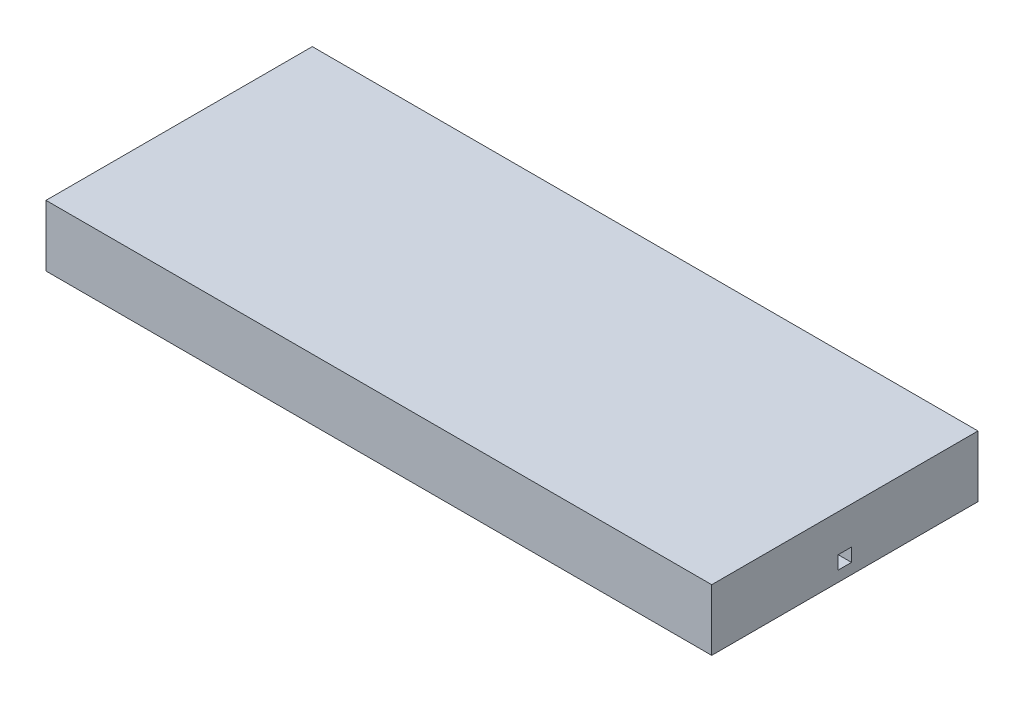
ISO-10303-21;
HEADER;
FILE_DESCRIPTION(('STEP AP214'),'2;1');
FILE_NAME('part.step','',(''),(''),'','','');
FILE_SCHEMA(('AUTOMOTIVE_DESIGN { 1 0 10303 214 1 1 1 1 }'));
ENDSEC;
DATA;
#1=APPLICATION_CONTEXT('core data for automotive mechanical design processes');
#2=APPLICATION_PROTOCOL_DEFINITION('international standard','automotive_design',2000,#1);
#3=PRODUCT_CONTEXT('',#1,'mechanical');
#4=PRODUCT('Part','Part','',(#3));
#5=PRODUCT_RELATED_PRODUCT_CATEGORY('part','',(#4));
#6=PRODUCT_DEFINITION_FORMATION('','',#4);
#7=PRODUCT_DEFINITION_CONTEXT('part definition',#1,'design');
#8=PRODUCT_DEFINITION('design','',#6,#7);
#9=PRODUCT_DEFINITION_SHAPE('','',#8);
#10=(LENGTH_UNIT() NAMED_UNIT(*) SI_UNIT(.MILLI.,.METRE.));
#11=(NAMED_UNIT(*) PLANE_ANGLE_UNIT() SI_UNIT($,.RADIAN.));
#12=(NAMED_UNIT(*) SI_UNIT($,.STERADIAN.) SOLID_ANGLE_UNIT());
#13=UNCERTAINTY_MEASURE_WITH_UNIT(LENGTH_MEASURE(1.E-05),#10,'distance_accuracy_value','');
#14=(GEOMETRIC_REPRESENTATION_CONTEXT(3) GLOBAL_UNCERTAINTY_ASSIGNED_CONTEXT((#13)) GLOBAL_UNIT_ASSIGNED_CONTEXT((#10,
#11,#12)) REPRESENTATION_CONTEXT('',''));
#15=CARTESIAN_POINT('',(0.,0.,0.));
#16=DIRECTION('',(0.,0.,1.));
#17=DIRECTION('',(1.,0.,0.));
#18=AXIS2_PLACEMENT_3D('',#15,#16,#17);
#19=CARTESIAN_POINT('',(25.001,0.400000000000001,-4.75));
#20=DIRECTION('',(0.,-1.,0.));
#21=DIRECTION('',(0.,0.,-1.));
#22=AXIS2_PLACEMENT_3D('',#19,#20,#21);
#23=PLANE('',#22);
#24=DIRECTION('',(-1.,0.,0.));
#25=VECTOR('',#24,1.);
#26=CARTESIAN_POINT('',(25.001,0.400000000000001,-5.25));
#27=LINE('',#26,#25);
#28=CARTESIAN_POINT('',(7.77500000000001,0.4,-5.25));
#29=VERTEX_POINT('',#28);
#30=CARTESIAN_POINT('',(5.625,0.4,-5.25));
#31=VERTEX_POINT('',#30);
#32=EDGE_CURVE('E418',#29,#31,#27,.T.);
#33=ORIENTED_EDGE('',*,*,#32,.T.);
#34=DIRECTION('',(0.,0.,1.));
#35=VECTOR('',#34,1.);
#36=CARTESIAN_POINT('',(5.625,0.4,-6.));
#37=LINE('',#36,#35);
#38=CARTESIAN_POINT('',(5.625,0.4,-4.75));
#39=VERTEX_POINT('',#38);
#40=EDGE_CURVE('E221',#31,#39,#37,.T.);
#41=ORIENTED_EDGE('',*,*,#40,.T.);
#42=DIRECTION('',(-1.,0.,0.));
#43=VECTOR('',#42,1.);
#44=CARTESIAN_POINT('',(25.001,0.400000000000001,-4.75));
#45=LINE('',#44,#43);
#46=CARTESIAN_POINT('',(7.775,0.400000000000001,-4.75));
#47=VERTEX_POINT('',#46);
#48=EDGE_CURVE('E448',#47,#39,#45,.T.);
#49=ORIENTED_EDGE('',*,*,#48,.F.);
#50=DIRECTION('',(0.,0.,-1.));
#51=VECTOR('',#50,1.);
#52=CARTESIAN_POINT('',(7.775,0.4,-4.225));
#53=LINE('',#52,#51);
#54=EDGE_CURVE('E338',#47,#29,#53,.T.);
#55=ORIENTED_EDGE('',*,*,#54,.T.);
#56=EDGE_LOOP('',(#33,#41,#49,#55));
#57=FACE_BOUND('',#56,.T.);
#58=ADVANCED_FACE('F39',(#57),#23,.F.);
#59=CARTESIAN_POINT('',(25.,0.400000000000001,-5.25));
#60=VERTEX_POINT('',#59);
#61=CARTESIAN_POINT('',(12.025,0.4,-5.25));
#62=VERTEX_POINT('',#61);
#63=EDGE_CURVE('E324',#60,#62,#27,.T.);
#64=ORIENTED_EDGE('',*,*,#63,.T.);
#65=DIRECTION('',(0.,0.,1.));
#66=VECTOR('',#65,1.);
#67=CARTESIAN_POINT('',(12.025,0.400000000000001,-4.75));
#68=LINE('',#67,#66);
#69=CARTESIAN_POINT('',(12.025,0.4,-4.75));
#70=VERTEX_POINT('',#69);
#71=EDGE_CURVE('E11',#62,#70,#68,.T.);
#72=ORIENTED_EDGE('',*,*,#71,.T.);
#73=CARTESIAN_POINT('',(25.,0.400000000000001,-4.75));
#74=VERTEX_POINT('',#73);
#75=EDGE_CURVE('E318',#74,#70,#45,.T.);
#76=ORIENTED_EDGE('',*,*,#75,.F.);
#77=DIRECTION('',(0.,0.,-1.));
#78=VECTOR('',#77,1.);
#79=CARTESIAN_POINT('',(25.,0.400000000000001,-4.75));
#80=LINE('',#79,#78);
#81=EDGE_CURVE('E315',#74,#60,#80,.T.);
#82=ORIENTED_EDGE('',*,*,#81,.T.);
#83=EDGE_LOOP('',(#64,#72,#76,#82));
#84=FACE_BOUND('',#83,.T.);
#85=ADVANCED_FACE('F484',(#84),#23,.F.);
#86=CARTESIAN_POINT('',(0.,0.4,0.));
#87=DIRECTION('',(0.,1.,0.));
#88=DIRECTION('',(0.,0.,1.));
#89=AXIS2_PLACEMENT_3D('',#86,#87,#88);
#90=PLANE('',#89);
#91=CARTESIAN_POINT('',(8.625,0.400000000000001,-4.75));
#92=VERTEX_POINT('',#91);
#93=EDGE_CURVE('E323',#92,#47,#45,.T.);
#94=ORIENTED_EDGE('',*,*,#93,.F.);
#95=DIRECTION('',(0.,0.,1.));
#96=VECTOR('',#95,1.);
#97=CARTESIAN_POINT('',(8.625,0.4,-4.225));
#98=LINE('',#97,#96);
#99=CARTESIAN_POINT('',(8.625,0.4,-4.225));
#100=VERTEX_POINT('',#99);
#101=EDGE_CURVE('E341',#92,#100,#98,.T.);
#102=ORIENTED_EDGE('',*,*,#101,.T.);
#103=DIRECTION('',(-1.,0.,0.));
#104=VECTOR('',#103,1.);
#105=CARTESIAN_POINT('',(8.625,0.4,-4.225));
#106=LINE('',#105,#104);
#107=CARTESIAN_POINT('',(7.775,0.4,-4.225));
#108=VERTEX_POINT('',#107);
#109=EDGE_CURVE('E345',#100,#108,#106,.T.);
#110=ORIENTED_EDGE('',*,*,#109,.T.);
#111=EDGE_CURVE('E333',#108,#47,#53,.T.);
#112=ORIENTED_EDGE('',*,*,#111,.T.);
#113=EDGE_LOOP('',(#94,#102,#110,#112));
#114=FACE_BOUND('',#113,.T.);
#115=ADVANCED_FACE('F457',(#114),#90,.F.);
#116=CARTESIAN_POINT('',(0.,2.3,0.));
#117=DIRECTION('',(1.,0.,0.));
#118=DIRECTION('',(0.,0.,-1.));
#119=AXIS2_PLACEMENT_3D('',#116,#117,#118);
#120=PLANE('',#119);
#121=DIRECTION('',(0.,0.,1.));
#122=VECTOR('',#121,1.);
#123=CARTESIAN_POINT('',(0.,0.400000000000001,-4.75));
#124=LINE('',#123,#122);
#125=CARTESIAN_POINT('',(0.,0.400000000000001,-5.25));
#126=VERTEX_POINT('',#125);
#127=CARTESIAN_POINT('',(0.,0.400000000000001,-4.75));
#128=VERTEX_POINT('',#127);
#129=EDGE_CURVE('E303',#126,#128,#124,.T.);
#130=ORIENTED_EDGE('',*,*,#129,.F.);
#131=DIRECTION('',(0.,-1.,0.));
#132=VECTOR('',#131,1.);
#133=CARTESIAN_POINT('',(0.,0.400000000000001,-5.25));
#134=LINE('',#133,#132);
#135=CARTESIAN_POINT('',(0.,0.900000000000001,-5.25));
#136=VERTEX_POINT('',#135);
#137=EDGE_CURVE('E300',#136,#126,#134,.T.);
#138=ORIENTED_EDGE('',*,*,#137,.F.);
#139=DIRECTION('',(0.,0.,-1.));
#140=VECTOR('',#139,1.);
#141=CARTESIAN_POINT('',(0.,0.900000000000001,-4.75));
#142=LINE('',#141,#140);
#143=CARTESIAN_POINT('',(0.,0.900000000000001,-4.75));
#144=VERTEX_POINT('',#143);
#145=EDGE_CURVE('E309',#144,#136,#142,.T.);
#146=ORIENTED_EDGE('',*,*,#145,.F.);
#147=DIRECTION('',(0.,1.,0.));
#148=VECTOR('',#147,1.);
#149=CARTESIAN_POINT('',(0.,0.400000000000001,-4.75));
#150=LINE('',#149,#148);
#151=EDGE_CURVE('E306',#128,#144,#150,.T.);
#152=ORIENTED_EDGE('',*,*,#151,.F.);
#153=EDGE_LOOP('',(#130,#138,#146,#152));
#154=FACE_BOUND('',#153,.T.);
#155=DIRECTION('',(0.,0.,1.));
#156=VECTOR('',#155,1.);
#157=CARTESIAN_POINT('',(0.,0.,0.));
#158=LINE('',#157,#156);
#159=CARTESIAN_POINT('',(0.,0.,-10.));
#160=VERTEX_POINT('',#159);
#161=CARTESIAN_POINT('',(0.,0.,0.));
#162=VERTEX_POINT('',#161);
#163=EDGE_CURVE('E362',#160,#162,#158,.T.);
#164=ORIENTED_EDGE('',*,*,#163,.T.);
#165=DIRECTION('',(0.,-1.,0.));
#166=VECTOR('',#165,1.);
#167=CARTESIAN_POINT('',(0.,2.3,0.));
#168=LINE('',#167,#166);
#169=CARTESIAN_POINT('',(0.,2.3,0.));
#170=VERTEX_POINT('',#169);
#171=EDGE_CURVE('E395',#170,#162,#168,.T.);
#172=ORIENTED_EDGE('',*,*,#171,.F.);
#173=DIRECTION('',(0.,0.,1.));
#174=VECTOR('',#173,1.);
#175=CARTESIAN_POINT('',(0.,2.3,0.));
#176=LINE('',#175,#174);
#177=CARTESIAN_POINT('',(0.,2.3,-10.));
#178=VERTEX_POINT('',#177);
#179=EDGE_CURVE('E369',#178,#170,#176,.T.);
#180=ORIENTED_EDGE('',*,*,#179,.F.);
#181=DIRECTION('',(0.,-1.,0.));
#182=VECTOR('',#181,1.);
#183=CARTESIAN_POINT('',(0.,2.3,-10.));
#184=LINE('',#183,#182);
#185=EDGE_CURVE('E379',#178,#160,#184,.T.);
#186=ORIENTED_EDGE('',*,*,#185,.T.);
#187=EDGE_LOOP('',(#164,#172,#180,#186));
#188=FACE_BOUND('',#187,.T.);
#189=ADVANCED_FACE('F41',(#154,#188),#120,.F.);
#190=CARTESIAN_POINT('',(0.,2.3,0.));
#191=DIRECTION('',(0.,0.,-1.));
#192=DIRECTION('',(-1.,0.,0.));
#193=AXIS2_PLACEMENT_3D('',#190,#191,#192);
#194=PLANE('',#193);
#195=DIRECTION('',(1.,0.,0.));
#196=VECTOR('',#195,1.);
#197=CARTESIAN_POINT('',(0.,0.,0.));
#198=LINE('',#197,#196);
#199=CARTESIAN_POINT('',(25.,0.,0.));
#200=VERTEX_POINT('',#199);
#201=EDGE_CURVE('E382',#162,#200,#198,.T.);
#202=ORIENTED_EDGE('',*,*,#201,.T.);
#203=DIRECTION('',(0.,-1.,0.));
#204=VECTOR('',#203,1.);
#205=CARTESIAN_POINT('',(25.,2.3,0.));
#206=LINE('',#205,#204);
#207=CARTESIAN_POINT('',(25.,2.3,0.));
#208=VERTEX_POINT('',#207);
#209=EDGE_CURVE('E392',#208,#200,#206,.T.);
#210=ORIENTED_EDGE('',*,*,#209,.F.);
#211=DIRECTION('',(1.,0.,0.));
#212=VECTOR('',#211,1.);
#213=CARTESIAN_POINT('',(0.,2.3,0.));
#214=LINE('',#213,#212);
#215=EDGE_CURVE('E372',#170,#208,#214,.T.);
#216=ORIENTED_EDGE('',*,*,#215,.F.);
#217=ORIENTED_EDGE('',*,*,#171,.T.);
#218=EDGE_LOOP('',(#202,#210,#216,#217));
#219=FACE_BOUND('',#218,.T.);
#220=ADVANCED_FACE('F711',(#219),#194,.F.);
#221=CARTESIAN_POINT('',(25.,2.3,0.));
#222=DIRECTION('',(-1.,0.,0.));
#223=DIRECTION('',(0.,0.,1.));
#224=AXIS2_PLACEMENT_3D('',#221,#222,#223);
#225=PLANE('',#224);
#226=DIRECTION('',(0.,0.,1.));
#227=VECTOR('',#226,1.);
#228=CARTESIAN_POINT('',(25.,0.900000000000001,-4.75));
#229=LINE('',#228,#227);
#230=CARTESIAN_POINT('',(25.,0.900000000000001,-5.25));
#231=VERTEX_POINT('',#230);
#232=CARTESIAN_POINT('',(25.,0.900000000000001,-4.75));
#233=VERTEX_POINT('',#232);
#234=EDGE_CURVE('E294',#231,#233,#229,.T.);
#235=ORIENTED_EDGE('',*,*,#234,.F.);
#236=DIRECTION('',(0.,1.,0.));
#237=VECTOR('',#236,1.);
#238=CARTESIAN_POINT('',(25.,0.400000000000001,-5.25));
#239=LINE('',#238,#237);
#240=EDGE_CURVE('E297',#60,#231,#239,.T.);
#241=ORIENTED_EDGE('',*,*,#240,.F.);
#242=ORIENTED_EDGE('',*,*,#81,.F.);
#243=DIRECTION('',(0.,-1.,0.));
#244=VECTOR('',#243,1.);
#245=CARTESIAN_POINT('',(25.,0.400000000000001,-4.75));
#246=LINE('',#245,#244);
#247=EDGE_CURVE('E292',#233,#74,#246,.T.);
#248=ORIENTED_EDGE('',*,*,#247,.F.);
#249=EDGE_LOOP('',(#235,#241,#242,#248));
#250=FACE_BOUND('',#249,.T.);
#251=DIRECTION('',(0.,0.,-1.));
#252=VECTOR('',#251,1.);
#253=CARTESIAN_POINT('',(25.,0.,0.));
#254=LINE('',#253,#252);
#255=CARTESIAN_POINT('',(25.,0.,-10.));
#256=VERTEX_POINT('',#255);
#257=EDGE_CURVE('E384',#200,#256,#254,.T.);
#258=ORIENTED_EDGE('',*,*,#257,.T.);
#259=DIRECTION('',(0.,-1.,0.));
#260=VECTOR('',#259,1.);
#261=CARTESIAN_POINT('',(25.,2.3,-10.));
#262=LINE('',#261,#260);
#263=CARTESIAN_POINT('',(25.,2.3,-10.));
#264=VERTEX_POINT('',#263);
#265=EDGE_CURVE('E389',#264,#256,#262,.T.);
#266=ORIENTED_EDGE('',*,*,#265,.F.);
#267=DIRECTION('',(0.,0.,-1.));
#268=VECTOR('',#267,1.);
#269=CARTESIAN_POINT('',(25.,2.3,0.));
#270=LINE('',#269,#268);
#271=EDGE_CURVE('E375',#208,#264,#270,.T.);
#272=ORIENTED_EDGE('',*,*,#271,.F.);
#273=ORIENTED_EDGE('',*,*,#209,.T.);
#274=EDGE_LOOP('',(#258,#266,#272,#273));
#275=FACE_BOUND('',#274,.T.);
#276=ADVANCED_FACE('F702',(#250,#275),#225,.F.);
#277=CARTESIAN_POINT('',(0.,2.3,-10.));
#278=DIRECTION('',(0.,0.,1.));
#279=DIRECTION('',(1.,0.,0.));
#280=AXIS2_PLACEMENT_3D('',#277,#278,#279);
#281=PLANE('',#280);
#282=DIRECTION('',(-1.,0.,0.));
#283=VECTOR('',#282,1.);
#284=CARTESIAN_POINT('',(0.,0.,-10.));
#285=LINE('',#284,#283);
#286=EDGE_CURVE('E373',#256,#160,#285,.T.);
#287=ORIENTED_EDGE('',*,*,#286,.T.);
#288=ORIENTED_EDGE('',*,*,#185,.F.);
#289=DIRECTION('',(-1.,0.,0.));
#290=VECTOR('',#289,1.);
#291=CARTESIAN_POINT('',(0.,2.3,-10.));
#292=LINE('',#291,#290);
#293=EDGE_CURVE('E377',#264,#178,#292,.T.);
#294=ORIENTED_EDGE('',*,*,#293,.F.);
#295=ORIENTED_EDGE('',*,*,#265,.T.);
#296=EDGE_LOOP('',(#287,#288,#294,#295));
#297=FACE_BOUND('',#296,.T.);
#298=ADVANCED_FACE('F693',(#297),#281,.F.);
#299=CARTESIAN_POINT('',(0.,2.3,0.));
#300=DIRECTION('',(0.,-1.,0.));
#301=DIRECTION('',(0.,0.,-1.));
#302=AXIS2_PLACEMENT_3D('',#299,#300,#301);
#303=PLANE('',#302);
#304=ORIENTED_EDGE('',*,*,#179,.T.);
#305=ORIENTED_EDGE('',*,*,#215,.T.);
#306=ORIENTED_EDGE('',*,*,#271,.T.);
#307=ORIENTED_EDGE('',*,*,#293,.T.);
#308=EDGE_LOOP('',(#304,#305,#306,#307));
#309=FACE_BOUND('',#308,.T.);
#310=ADVANCED_FACE('F685',(#309),#303,.F.);
#311=CARTESIAN_POINT('',(0.,0.,0.));
#312=DIRECTION('',(0.,-1.,0.));
#313=DIRECTION('',(0.,0.,-1.));
#314=AXIS2_PLACEMENT_3D('',#311,#312,#313);
#315=PLANE('',#314);
#316=DIRECTION('',(0.,0.,1.));
#317=VECTOR('',#316,1.);
#318=CARTESIAN_POINT('',(5.625,0.,-6.));
#319=LINE('',#318,#317);
#320=CARTESIAN_POINT('',(5.625,0.,-6.));
#321=VERTEX_POINT('',#320);
#322=CARTESIAN_POINT('',(5.625,0.,-4.));
#323=VERTEX_POINT('',#322);
#324=EDGE_CURVE('E54',#321,#323,#319,.T.);
#325=ORIENTED_EDGE('',*,*,#324,.F.);
#326=DIRECTION('',(1.,0.,0.));
#327=VECTOR('',#326,1.);
#328=CARTESIAN_POINT('',(4.375,0.,-6.));
#329=LINE('',#328,#327);
#330=CARTESIAN_POINT('',(4.375,0.,-6.));
#331=VERTEX_POINT('',#330);
#332=EDGE_CURVE('E222',#331,#321,#329,.T.);
#333=ORIENTED_EDGE('',*,*,#332,.F.);
#334=DIRECTION('',(0.,0.,-1.));
#335=VECTOR('',#334,1.);
#336=CARTESIAN_POINT('',(4.375,0.,-6.));
#337=LINE('',#336,#335);
#338=CARTESIAN_POINT('',(4.375,0.,-4.));
#339=VERTEX_POINT('',#338);
#340=EDGE_CURVE('E248',#339,#331,#337,.T.);
#341=ORIENTED_EDGE('',*,*,#340,.F.);
#342=DIRECTION('',(-1.,0.,0.));
#343=VECTOR('',#342,1.);
#344=CARTESIAN_POINT('',(4.375,0.,-4.));
#345=LINE('',#344,#343);
#346=EDGE_CURVE('E245',#323,#339,#345,.T.);
#347=ORIENTED_EDGE('',*,*,#346,.F.);
#348=EDGE_LOOP('',(#325,#333,#341,#347));
#349=FACE_BOUND('',#348,.T.);
#350=DIRECTION('',(0.,0.,1.));
#351=VECTOR('',#350,1.);
#352=CARTESIAN_POINT('',(12.025,0.,-6.));
#353=LINE('',#352,#351);
#354=CARTESIAN_POINT('',(12.025,0.,-6.));
#355=VERTEX_POINT('',#354);
#356=CARTESIAN_POINT('',(12.025,0.,-4.));
#357=VERTEX_POINT('',#356);
#358=EDGE_CURVE('E62',#355,#357,#353,.T.);
#359=ORIENTED_EDGE('',*,*,#358,.F.);
#360=DIRECTION('',(1.,0.,0.));
#361=VECTOR('',#360,1.);
#362=CARTESIAN_POINT('',(10.775,0.,-6.));
#363=LINE('',#362,#361);
#364=CARTESIAN_POINT('',(10.775,0.,-6.));
#365=VERTEX_POINT('',#364);
#366=EDGE_CURVE('E281',#365,#355,#363,.T.);
#367=ORIENTED_EDGE('',*,*,#366,.F.);
#368=DIRECTION('',(0.,0.,-1.));
#369=VECTOR('',#368,1.);
#370=CARTESIAN_POINT('',(10.775,0.,-6.));
#371=LINE('',#370,#369);
#372=CARTESIAN_POINT('',(10.775,0.,-4.));
#373=VERTEX_POINT('',#372);
#374=EDGE_CURVE('E278',#373,#365,#371,.T.);
#375=ORIENTED_EDGE('',*,*,#374,.F.);
#376=DIRECTION('',(-1.,0.,0.));
#377=VECTOR('',#376,1.);
#378=CARTESIAN_POINT('',(10.775,0.,-4.));
#379=LINE('',#378,#377);
#380=EDGE_CURVE('E275',#357,#373,#379,.T.);
#381=ORIENTED_EDGE('',*,*,#380,.F.);
#382=EDGE_LOOP('',(#359,#367,#375,#381));
#383=FACE_BOUND('',#382,.T.);
#384=DIRECTION('',(0.,0.,-1.));
#385=VECTOR('',#384,1.);
#386=CARTESIAN_POINT('',(7.775,0.,-4.225));
#387=LINE('',#386,#385);
#388=CARTESIAN_POINT('',(7.775,0.,-4.225));
#389=VERTEX_POINT('',#388);
#390=CARTESIAN_POINT('',(7.77500000000001,0.,-5.775));
#391=VERTEX_POINT('',#390);
#392=EDGE_CURVE('E349',#389,#391,#387,.T.);
#393=ORIENTED_EDGE('',*,*,#392,.F.);
#394=DIRECTION('',(-1.,0.,0.));
#395=VECTOR('',#394,1.);
#396=CARTESIAN_POINT('',(8.625,0.,-4.225));
#397=LINE('',#396,#395);
#398=CARTESIAN_POINT('',(8.625,0.,-4.225));
#399=VERTEX_POINT('',#398);
#400=EDGE_CURVE('E357',#399,#389,#397,.T.);
#401=ORIENTED_EDGE('',*,*,#400,.F.);
#402=DIRECTION('',(0.,0.,1.));
#403=VECTOR('',#402,1.);
#404=CARTESIAN_POINT('',(8.625,0.,-4.225));
#405=LINE('',#404,#403);
#406=CARTESIAN_POINT('',(8.62500000000001,0.,-5.775));
#407=VERTEX_POINT('',#406);
#408=EDGE_CURVE('E354',#407,#399,#405,.T.);
#409=ORIENTED_EDGE('',*,*,#408,.F.);
#410=DIRECTION('',(1.,0.,0.));
#411=VECTOR('',#410,1.);
#412=CARTESIAN_POINT('',(8.62500000000001,0.,-5.775));
#413=LINE('',#412,#411);
#414=EDGE_CURVE('E351',#391,#407,#413,.T.);
#415=ORIENTED_EDGE('',*,*,#414,.F.);
#416=EDGE_LOOP('',(#393,#401,#409,#415));
#417=FACE_BOUND('',#416,.T.);
#418=ORIENTED_EDGE('',*,*,#163,.F.);
#419=ORIENTED_EDGE('',*,*,#286,.F.);
#420=ORIENTED_EDGE('',*,*,#257,.F.);
#421=ORIENTED_EDGE('',*,*,#201,.F.);
#422=EDGE_LOOP('',(#418,#419,#420,#421));
#423=FACE_BOUND('',#422,.T.);
#424=ADVANCED_FACE('F470',(#349,#383,#417,#423),#315,.T.);
#425=CARTESIAN_POINT('',(7.775,0.4,-4.225));
#426=DIRECTION('',(-1.,0.,0.));
#427=DIRECTION('',(0.,0.,1.));
#428=AXIS2_PLACEMENT_3D('',#425,#426,#427);
#429=PLANE('',#428);
#430=ORIENTED_EDGE('',*,*,#392,.T.);
#431=DIRECTION('',(0.,-1.,0.));
#432=VECTOR('',#431,1.);
#433=CARTESIAN_POINT('',(7.77500000000001,0.4,-5.775));
#434=LINE('',#433,#432);
#435=CARTESIAN_POINT('',(7.77500000000001,0.4,-5.775));
#436=VERTEX_POINT('',#435);
#437=EDGE_CURVE('E348',#436,#391,#434,.T.);
#438=ORIENTED_EDGE('',*,*,#437,.F.);
#439=EDGE_CURVE('E337',#29,#436,#53,.T.);
#440=ORIENTED_EDGE('',*,*,#439,.F.);
#441=ORIENTED_EDGE('',*,*,#54,.F.);
#442=ORIENTED_EDGE('',*,*,#111,.F.);
#443=DIRECTION('',(0.,-1.,0.));
#444=VECTOR('',#443,1.);
#445=CARTESIAN_POINT('',(7.775,0.4,-4.225));
#446=LINE('',#445,#444);
#447=EDGE_CURVE('E360',#108,#389,#446,.T.);
#448=ORIENTED_EDGE('',*,*,#447,.T.);
#449=EDGE_LOOP('',(#430,#438,#440,#441,#442,#448));
#450=FACE_BOUND('',#449,.T.);
#451=ADVANCED_FACE('F455',(#450),#429,.F.);
#452=CARTESIAN_POINT('',(8.625,0.4,-4.225));
#453=DIRECTION('',(0.,0.,1.));
#454=DIRECTION('',(1.,0.,0.));
#455=AXIS2_PLACEMENT_3D('',#452,#453,#454);
#456=PLANE('',#455);
#457=ORIENTED_EDGE('',*,*,#400,.T.);
#458=ORIENTED_EDGE('',*,*,#447,.F.);
#459=ORIENTED_EDGE('',*,*,#109,.F.);
#460=DIRECTION('',(0.,-1.,0.));
#461=VECTOR('',#460,1.);
#462=CARTESIAN_POINT('',(8.625,0.4,-4.225));
#463=LINE('',#462,#461);
#464=EDGE_CURVE('E363',#100,#399,#463,.T.);
#465=ORIENTED_EDGE('',*,*,#464,.T.);
#466=EDGE_LOOP('',(#457,#458,#459,#465));
#467=FACE_BOUND('',#466,.T.);
#468=ADVANCED_FACE('F461',(#467),#456,.F.);
#469=CARTESIAN_POINT('',(8.625,0.4,-4.225));
#470=DIRECTION('',(1.,0.,0.));
#471=DIRECTION('',(0.,0.,-1.));
#472=AXIS2_PLACEMENT_3D('',#469,#470,#471);
#473=PLANE('',#472);
#474=ORIENTED_EDGE('',*,*,#408,.T.);
#475=ORIENTED_EDGE('',*,*,#464,.F.);
#476=ORIENTED_EDGE('',*,*,#101,.F.);
#477=CARTESIAN_POINT('',(8.625,0.400000000000001,-5.25));
#478=VERTEX_POINT('',#477);
#479=EDGE_CURVE('E332',#478,#92,#98,.T.);
#480=ORIENTED_EDGE('',*,*,#479,.F.);
#481=CARTESIAN_POINT('',(8.62500000000001,0.4,-5.775));
#482=VERTEX_POINT('',#481);
#483=EDGE_CURVE('E342',#482,#478,#98,.T.);
#484=ORIENTED_EDGE('',*,*,#483,.F.);
#485=DIRECTION('',(0.,-1.,0.));
#486=VECTOR('',#485,1.);
#487=CARTESIAN_POINT('',(8.62500000000001,0.4,-5.775));
#488=LINE('',#487,#486);
#489=EDGE_CURVE('E365',#482,#407,#488,.T.);
#490=ORIENTED_EDGE('',*,*,#489,.T.);
#491=EDGE_LOOP('',(#474,#475,#476,#480,#484,#490));
#492=FACE_BOUND('',#491,.T.);
#493=ADVANCED_FACE('F473',(#492),#473,.F.);
#494=CARTESIAN_POINT('',(8.62500000000001,0.4,-5.775));
#495=DIRECTION('',(0.,0.,-1.));
#496=DIRECTION('',(-1.,0.,0.));
#497=AXIS2_PLACEMENT_3D('',#494,#495,#496);
#498=PLANE('',#497);
#499=ORIENTED_EDGE('',*,*,#414,.T.);
#500=ORIENTED_EDGE('',*,*,#489,.F.);
#501=DIRECTION('',(1.,0.,0.));
#502=VECTOR('',#501,1.);
#503=CARTESIAN_POINT('',(8.62500000000001,0.4,-5.775));
#504=LINE('',#503,#502);
#505=EDGE_CURVE('E336',#436,#482,#504,.T.);
#506=ORIENTED_EDGE('',*,*,#505,.F.);
#507=ORIENTED_EDGE('',*,*,#437,.T.);
#508=EDGE_LOOP('',(#499,#500,#506,#507));
#509=FACE_BOUND('',#508,.T.);
#510=ADVANCED_FACE('F468',(#509),#498,.F.);
#511=ORIENTED_EDGE('',*,*,#483,.T.);
#512=EDGE_CURVE('E329',#478,#29,#27,.T.);
#513=ORIENTED_EDGE('',*,*,#512,.T.);
#514=ORIENTED_EDGE('',*,*,#439,.T.);
#515=ORIENTED_EDGE('',*,*,#505,.T.);
#516=EDGE_LOOP('',(#511,#513,#514,#515));
#517=FACE_BOUND('',#516,.T.);
#518=ADVANCED_FACE('F476',(#517),#90,.F.);
#519=CARTESIAN_POINT('',(4.375,0.400000000000001,-4.75));
#520=VERTEX_POINT('',#519);
#521=EDGE_CURVE('E322',#520,#128,#45,.T.);
#522=ORIENTED_EDGE('',*,*,#521,.F.);
#523=DIRECTION('',(0.,0.,-1.));
#524=VECTOR('',#523,1.);
#525=CARTESIAN_POINT('',(4.375,0.4,-6.));
#526=LINE('',#525,#524);
#527=CARTESIAN_POINT('',(4.375,0.4,-5.25));
#528=VERTEX_POINT('',#527);
#529=EDGE_CURVE('E237',#520,#528,#526,.T.);
#530=ORIENTED_EDGE('',*,*,#529,.T.);
#531=EDGE_CURVE('E312',#528,#126,#27,.T.);
#532=ORIENTED_EDGE('',*,*,#531,.T.);
#533=ORIENTED_EDGE('',*,*,#129,.T.);
#534=EDGE_LOOP('',(#522,#530,#532,#533));
#535=FACE_BOUND('',#534,.T.);
#536=ADVANCED_FACE('F442',(#535),#23,.F.);
#537=CARTESIAN_POINT('',(25.001,0.400000000000001,-5.25));
#538=DIRECTION('',(0.,0.,-1.));
#539=DIRECTION('',(-1.,0.,0.));
#540=AXIS2_PLACEMENT_3D('',#537,#538,#539);
#541=PLANE('',#540);
#542=ORIENTED_EDGE('',*,*,#240,.T.);
#543=DIRECTION('',(-1.,0.,0.));
#544=VECTOR('',#543,1.);
#545=CARTESIAN_POINT('',(25.001,0.900000000000001,-5.25));
#546=LINE('',#545,#544);
#547=EDGE_CURVE('E313',#231,#136,#546,.T.);
#548=ORIENTED_EDGE('',*,*,#547,.T.);
#549=ORIENTED_EDGE('',*,*,#137,.T.);
#550=ORIENTED_EDGE('',*,*,#531,.F.);
#551=DIRECTION('',(1.,0.,0.));
#552=VECTOR('',#551,1.);
#553=CARTESIAN_POINT('',(25.001,0.4,-5.25));
#554=LINE('',#553,#552);
#555=EDGE_CURVE('E255',#528,#31,#554,.T.);
#556=ORIENTED_EDGE('',*,*,#555,.T.);
#557=ORIENTED_EDGE('',*,*,#32,.F.);
#558=ORIENTED_EDGE('',*,*,#512,.F.);
#559=CARTESIAN_POINT('',(10.775,0.400000000000001,-5.25));
#560=VERTEX_POINT('',#559);
#561=EDGE_CURVE('E403',#560,#478,#27,.T.);
#562=ORIENTED_EDGE('',*,*,#561,.F.);
#563=EDGE_CURVE('E328',#62,#560,#27,.T.);
#564=ORIENTED_EDGE('',*,*,#563,.F.);
#565=ORIENTED_EDGE('',*,*,#63,.F.);
#566=EDGE_LOOP('',(#542,#548,#549,#550,#556,#557,#558,#562,#564,#565));
#567=FACE_BOUND('',#566,.T.);
#568=ADVANCED_FACE('F411',(#567),#541,.F.);
#569=CARTESIAN_POINT('',(25.001,0.900000000000001,-4.75));
#570=DIRECTION('',(0.,1.,0.));
#571=DIRECTION('',(0.,0.,1.));
#572=AXIS2_PLACEMENT_3D('',#569,#570,#571);
#573=PLANE('',#572);
#574=ORIENTED_EDGE('',*,*,#234,.T.);
#575=DIRECTION('',(-1.,0.,0.));
#576=VECTOR('',#575,1.);
#577=CARTESIAN_POINT('',(25.001,0.900000000000001,-4.75));
#578=LINE('',#577,#576);
#579=EDGE_CURVE('E316',#233,#144,#578,.T.);
#580=ORIENTED_EDGE('',*,*,#579,.T.);
#581=ORIENTED_EDGE('',*,*,#145,.T.);
#582=ORIENTED_EDGE('',*,*,#547,.F.);
#583=EDGE_LOOP('',(#574,#580,#581,#582));
#584=FACE_BOUND('',#583,.T.);
#585=ADVANCED_FACE('F504',(#584),#573,.F.);
#586=CARTESIAN_POINT('',(25.001,0.400000000000001,-4.75));
#587=DIRECTION('',(0.,0.,1.));
#588=DIRECTION('',(1.,0.,0.));
#589=AXIS2_PLACEMENT_3D('',#586,#587,#588);
#590=PLANE('',#589);
#591=ORIENTED_EDGE('',*,*,#247,.T.);
#592=ORIENTED_EDGE('',*,*,#75,.T.);
#593=CARTESIAN_POINT('',(10.775,0.4,-4.75));
#594=VERTEX_POINT('',#593);
#595=EDGE_CURVE('E321',#70,#594,#45,.T.);
#596=ORIENTED_EDGE('',*,*,#595,.T.);
#597=EDGE_CURVE('E405',#594,#92,#45,.T.);
#598=ORIENTED_EDGE('',*,*,#597,.T.);
#599=ORIENTED_EDGE('',*,*,#93,.T.);
#600=ORIENTED_EDGE('',*,*,#48,.T.);
#601=EDGE_CURVE('E219',#39,#520,#45,.T.);
#602=ORIENTED_EDGE('',*,*,#601,.T.);
#603=ORIENTED_EDGE('',*,*,#521,.T.);
#604=ORIENTED_EDGE('',*,*,#151,.T.);
#605=ORIENTED_EDGE('',*,*,#579,.F.);
#606=EDGE_LOOP('',(#591,#592,#596,#598,#599,#600,#602,#603,#604,#605));
#607=FACE_BOUND('',#606,.T.);
#608=ADVANCED_FACE('F446',(#607),#590,.F.);
#609=ORIENTED_EDGE('',*,*,#597,.F.);
#610=DIRECTION('',(0.,0.,-1.));
#611=VECTOR('',#610,1.);
#612=CARTESIAN_POINT('',(10.775,0.400000000000001,-4.75));
#613=LINE('',#612,#611);
#614=EDGE_CURVE('E47',#594,#560,#613,.T.);
#615=ORIENTED_EDGE('',*,*,#614,.T.);
#616=ORIENTED_EDGE('',*,*,#561,.T.);
#617=ORIENTED_EDGE('',*,*,#479,.T.);
#618=EDGE_LOOP('',(#609,#615,#616,#617));
#619=FACE_BOUND('',#618,.T.);
#620=ADVANCED_FACE('F401',(#619),#23,.F.);
#621=CARTESIAN_POINT('',(0.,0.4,0.));
#622=DIRECTION('',(0.,1.,0.));
#623=DIRECTION('',(0.,0.,1.));
#624=AXIS2_PLACEMENT_3D('',#621,#622,#623);
#625=PLANE('',#624);
#626=DIRECTION('',(0.,0.,-1.));
#627=VECTOR('',#626,1.);
#628=CARTESIAN_POINT('',(10.775,0.4,-6.));
#629=LINE('',#628,#627);
#630=CARTESIAN_POINT('',(10.775,0.4,-6.));
#631=VERTEX_POINT('',#630);
#632=EDGE_CURVE('E266',#560,#631,#629,.T.);
#633=ORIENTED_EDGE('',*,*,#632,.T.);
#634=DIRECTION('',(1.,0.,0.));
#635=VECTOR('',#634,1.);
#636=CARTESIAN_POINT('',(10.775,0.4,-6.));
#637=LINE('',#636,#635);
#638=CARTESIAN_POINT('',(12.025,0.4,-6.));
#639=VERTEX_POINT('',#638);
#640=EDGE_CURVE('E270',#631,#639,#637,.T.);
#641=ORIENTED_EDGE('',*,*,#640,.T.);
#642=DIRECTION('',(0.,0.,1.));
#643=VECTOR('',#642,1.);
#644=CARTESIAN_POINT('',(12.025,0.4,-6.));
#645=LINE('',#644,#643);
#646=EDGE_CURVE('E259',#639,#62,#645,.T.);
#647=ORIENTED_EDGE('',*,*,#646,.T.);
#648=ORIENTED_EDGE('',*,*,#563,.T.);
#649=EDGE_LOOP('',(#633,#641,#647,#648));
#650=FACE_BOUND('',#649,.T.);
#651=ADVANCED_FACE('F496',(#650),#625,.F.);
#652=CARTESIAN_POINT('',(12.025,0.4,-4.));
#653=VERTEX_POINT('',#652);
#654=EDGE_CURVE('E263',#70,#653,#645,.T.);
#655=ORIENTED_EDGE('',*,*,#654,.T.);
#656=DIRECTION('',(-1.,0.,0.));
#657=VECTOR('',#656,1.);
#658=CARTESIAN_POINT('',(10.775,0.4,-4.));
#659=LINE('',#658,#657);
#660=CARTESIAN_POINT('',(10.775,0.4,-4.));
#661=VERTEX_POINT('',#660);
#662=EDGE_CURVE('E262',#653,#661,#659,.T.);
#663=ORIENTED_EDGE('',*,*,#662,.T.);
#664=EDGE_CURVE('E267',#661,#594,#629,.T.);
#665=ORIENTED_EDGE('',*,*,#664,.T.);
#666=ORIENTED_EDGE('',*,*,#595,.F.);
#667=EDGE_LOOP('',(#655,#663,#665,#666));
#668=FACE_BOUND('',#667,.T.);
#669=ADVANCED_FACE('F501',(#668),#625,.F.);
#670=CARTESIAN_POINT('',(12.025,0.4,-6.));
#671=DIRECTION('',(1.,0.,0.));
#672=DIRECTION('',(0.,0.,-1.));
#673=AXIS2_PLACEMENT_3D('',#670,#671,#672);
#674=PLANE('',#673);
#675=ORIENTED_EDGE('',*,*,#358,.T.);
#676=DIRECTION('',(0.,-1.,0.));
#677=VECTOR('',#676,1.);
#678=CARTESIAN_POINT('',(12.025,0.4,-4.));
#679=LINE('',#678,#677);
#680=EDGE_CURVE('E273',#653,#357,#679,.T.);
#681=ORIENTED_EDGE('',*,*,#680,.F.);
#682=ORIENTED_EDGE('',*,*,#654,.F.);
#683=ORIENTED_EDGE('',*,*,#71,.F.);
#684=ORIENTED_EDGE('',*,*,#646,.F.);
#685=DIRECTION('',(0.,-1.,0.));
#686=VECTOR('',#685,1.);
#687=CARTESIAN_POINT('',(12.025,0.4,-6.));
#688=LINE('',#687,#686);
#689=EDGE_CURVE('E246',#639,#355,#688,.T.);
#690=ORIENTED_EDGE('',*,*,#689,.T.);
#691=EDGE_LOOP('',(#675,#681,#682,#683,#684,#690));
#692=FACE_BOUND('',#691,.T.);
#693=ADVANCED_FACE('F511',(#692),#674,.F.);
#694=CARTESIAN_POINT('',(10.775,0.4,-6.));
#695=DIRECTION('',(0.,0.,-1.));
#696=DIRECTION('',(-1.,0.,0.));
#697=AXIS2_PLACEMENT_3D('',#694,#695,#696);
#698=PLANE('',#697);
#699=ORIENTED_EDGE('',*,*,#366,.T.);
#700=ORIENTED_EDGE('',*,*,#689,.F.);
#701=ORIENTED_EDGE('',*,*,#640,.F.);
#702=DIRECTION('',(0.,-1.,0.));
#703=VECTOR('',#702,1.);
#704=CARTESIAN_POINT('',(10.775,0.4,-6.));
#705=LINE('',#704,#703);
#706=EDGE_CURVE('E285',#631,#365,#705,.T.);
#707=ORIENTED_EDGE('',*,*,#706,.T.);
#708=EDGE_LOOP('',(#699,#700,#701,#707));
#709=FACE_BOUND('',#708,.T.);
#710=ADVANCED_FACE('F514',(#709),#698,.F.);
#711=CARTESIAN_POINT('',(10.775,0.4,-6.));
#712=DIRECTION('',(-1.,0.,0.));
#713=DIRECTION('',(0.,0.,1.));
#714=AXIS2_PLACEMENT_3D('',#711,#712,#713);
#715=PLANE('',#714);
#716=ORIENTED_EDGE('',*,*,#374,.T.);
#717=ORIENTED_EDGE('',*,*,#706,.F.);
#718=ORIENTED_EDGE('',*,*,#632,.F.);
#719=ORIENTED_EDGE('',*,*,#614,.F.);
#720=ORIENTED_EDGE('',*,*,#664,.F.);
#721=DIRECTION('',(0.,-1.,0.));
#722=VECTOR('',#721,1.);
#723=CARTESIAN_POINT('',(10.775,0.4,-4.));
#724=LINE('',#723,#722);
#725=EDGE_CURVE('E287',#661,#373,#724,.T.);
#726=ORIENTED_EDGE('',*,*,#725,.T.);
#727=EDGE_LOOP('',(#716,#717,#718,#719,#720,#726));
#728=FACE_BOUND('',#727,.T.);
#729=ADVANCED_FACE('F518',(#728),#715,.F.);
#730=CARTESIAN_POINT('',(10.775,0.4,-4.));
#731=DIRECTION('',(0.,0.,1.));
#732=DIRECTION('',(1.,0.,0.));
#733=AXIS2_PLACEMENT_3D('',#730,#731,#732);
#734=PLANE('',#733);
#735=ORIENTED_EDGE('',*,*,#380,.T.);
#736=ORIENTED_EDGE('',*,*,#725,.F.);
#737=ORIENTED_EDGE('',*,*,#662,.F.);
#738=ORIENTED_EDGE('',*,*,#680,.T.);
#739=EDGE_LOOP('',(#735,#736,#737,#738));
#740=FACE_BOUND('',#739,.T.);
#741=ADVANCED_FACE('F515',(#740),#734,.F.);
#742=CARTESIAN_POINT('',(0.,0.4,0.));
#743=DIRECTION('',(0.,1.,0.));
#744=DIRECTION('',(0.,0.,1.));
#745=AXIS2_PLACEMENT_3D('',#742,#743,#744);
#746=PLANE('',#745);
#747=CARTESIAN_POINT('',(4.375,0.4,-6.));
#748=VERTEX_POINT('',#747);
#749=EDGE_CURVE('E235',#528,#748,#526,.T.);
#750=ORIENTED_EDGE('',*,*,#749,.T.);
#751=DIRECTION('',(1.,0.,0.));
#752=VECTOR('',#751,1.);
#753=CARTESIAN_POINT('',(4.375,0.4,-6.));
#754=LINE('',#753,#752);
#755=CARTESIAN_POINT('',(5.625,0.4,-6.));
#756=VERTEX_POINT('',#755);
#757=EDGE_CURVE('E231',#748,#756,#754,.T.);
#758=ORIENTED_EDGE('',*,*,#757,.T.);
#759=EDGE_CURVE('E224',#756,#31,#37,.T.);
#760=ORIENTED_EDGE('',*,*,#759,.T.);
#761=ORIENTED_EDGE('',*,*,#555,.F.);
#762=EDGE_LOOP('',(#750,#758,#760,#761));
#763=FACE_BOUND('',#762,.T.);
#764=ADVANCED_FACE('F434',(#763),#746,.F.);
#765=CARTESIAN_POINT('',(5.625,0.4,-4.));
#766=VERTEX_POINT('',#765);
#767=EDGE_CURVE('E214',#39,#766,#37,.T.);
#768=ORIENTED_EDGE('',*,*,#767,.T.);
#769=DIRECTION('',(-1.,0.,0.));
#770=VECTOR('',#769,1.);
#771=CARTESIAN_POINT('',(4.375,0.4,-4.));
#772=LINE('',#771,#770);
#773=CARTESIAN_POINT('',(4.375,0.4,-4.));
#774=VERTEX_POINT('',#773);
#775=EDGE_CURVE('E217',#766,#774,#772,.T.);
#776=ORIENTED_EDGE('',*,*,#775,.T.);
#777=EDGE_CURVE('E239',#774,#520,#526,.T.);
#778=ORIENTED_EDGE('',*,*,#777,.T.);
#779=ORIENTED_EDGE('',*,*,#601,.F.);
#780=EDGE_LOOP('',(#768,#776,#778,#779));
#781=FACE_BOUND('',#780,.T.);
#782=ADVANCED_FACE('F215',(#781),#746,.F.);
#783=CARTESIAN_POINT('',(5.625,0.4,-6.));
#784=DIRECTION('',(1.,0.,0.));
#785=DIRECTION('',(0.,0.,-1.));
#786=AXIS2_PLACEMENT_3D('',#783,#784,#785);
#787=PLANE('',#786);
#788=ORIENTED_EDGE('',*,*,#324,.T.);
#789=DIRECTION('',(0.,-1.,0.));
#790=VECTOR('',#789,1.);
#791=CARTESIAN_POINT('',(5.625,0.4,-4.));
#792=LINE('',#791,#790);
#793=EDGE_CURVE('E225',#766,#323,#792,.T.);
#794=ORIENTED_EDGE('',*,*,#793,.F.);
#795=ORIENTED_EDGE('',*,*,#767,.F.);
#796=ORIENTED_EDGE('',*,*,#40,.F.);
#797=ORIENTED_EDGE('',*,*,#759,.F.);
#798=DIRECTION('',(0.,-1.,0.));
#799=VECTOR('',#798,1.);
#800=CARTESIAN_POINT('',(5.625,0.4,-6.));
#801=LINE('',#800,#799);
#802=EDGE_CURVE('E253',#756,#321,#801,.T.);
#803=ORIENTED_EDGE('',*,*,#802,.T.);
#804=EDGE_LOOP('',(#788,#794,#795,#796,#797,#803));
#805=FACE_BOUND('',#804,.T.);
#806=ADVANCED_FACE('F226',(#805),#787,.F.);
#807=CARTESIAN_POINT('',(4.375,0.4,-6.));
#808=DIRECTION('',(0.,0.,-1.));
#809=DIRECTION('',(-1.,0.,0.));
#810=AXIS2_PLACEMENT_3D('',#807,#808,#809);
#811=PLANE('',#810);
#812=ORIENTED_EDGE('',*,*,#332,.T.);
#813=ORIENTED_EDGE('',*,*,#802,.F.);
#814=ORIENTED_EDGE('',*,*,#757,.F.);
#815=DIRECTION('',(0.,-1.,0.));
#816=VECTOR('',#815,1.);
#817=CARTESIAN_POINT('',(4.375,0.4,-6.));
#818=LINE('',#817,#816);
#819=EDGE_CURVE('E256',#748,#331,#818,.T.);
#820=ORIENTED_EDGE('',*,*,#819,.T.);
#821=EDGE_LOOP('',(#812,#813,#814,#820));
#822=FACE_BOUND('',#821,.T.);
#823=ADVANCED_FACE('F527',(#822),#811,.F.);
#824=CARTESIAN_POINT('',(4.375,0.4,-6.));
#825=DIRECTION('',(-1.,0.,0.));
#826=DIRECTION('',(0.,0.,1.));
#827=AXIS2_PLACEMENT_3D('',#824,#825,#826);
#828=PLANE('',#827);
#829=ORIENTED_EDGE('',*,*,#340,.T.);
#830=ORIENTED_EDGE('',*,*,#819,.F.);
#831=ORIENTED_EDGE('',*,*,#749,.F.);
#832=ORIENTED_EDGE('',*,*,#529,.F.);
#833=ORIENTED_EDGE('',*,*,#777,.F.);
#834=DIRECTION('',(0.,-1.,0.));
#835=VECTOR('',#834,1.);
#836=CARTESIAN_POINT('',(4.375,0.4,-4.));
#837=LINE('',#836,#835);
#838=EDGE_CURVE('E230',#774,#339,#837,.T.);
#839=ORIENTED_EDGE('',*,*,#838,.T.);
#840=EDGE_LOOP('',(#829,#830,#831,#832,#833,#839));
#841=FACE_BOUND('',#840,.T.);
#842=ADVANCED_FACE('F439',(#841),#828,.F.);
#843=CARTESIAN_POINT('',(4.375,0.4,-4.));
#844=DIRECTION('',(0.,0.,1.));
#845=DIRECTION('',(1.,0.,0.));
#846=AXIS2_PLACEMENT_3D('',#843,#844,#845);
#847=PLANE('',#846);
#848=ORIENTED_EDGE('',*,*,#346,.T.);
#849=ORIENTED_EDGE('',*,*,#838,.F.);
#850=ORIENTED_EDGE('',*,*,#775,.F.);
#851=ORIENTED_EDGE('',*,*,#793,.T.);
#852=EDGE_LOOP('',(#848,#849,#850,#851));
#853=FACE_BOUND('',#852,.T.);
#854=ADVANCED_FACE('F233',(#853),#847,.F.);
#855=CLOSED_SHELL('',(#58,#85,#115,#189,#220,#276,#298,#310,#424,#451,#468,#493,#510,#518,#536,
#568,#585,#608,#620,#651,#669,#693,#710,#729,#741,#764,#782,#806,#823,#842,#854));
#856=MANIFOLD_SOLID_BREP('B2',#855);
#857=ADVANCED_BREP_SHAPE_REPRESENTATION('',(#18,#856),#14);
#858=SHAPE_DEFINITION_REPRESENTATION(#9,#857);
ENDSEC;
END-ISO-10303-21;
